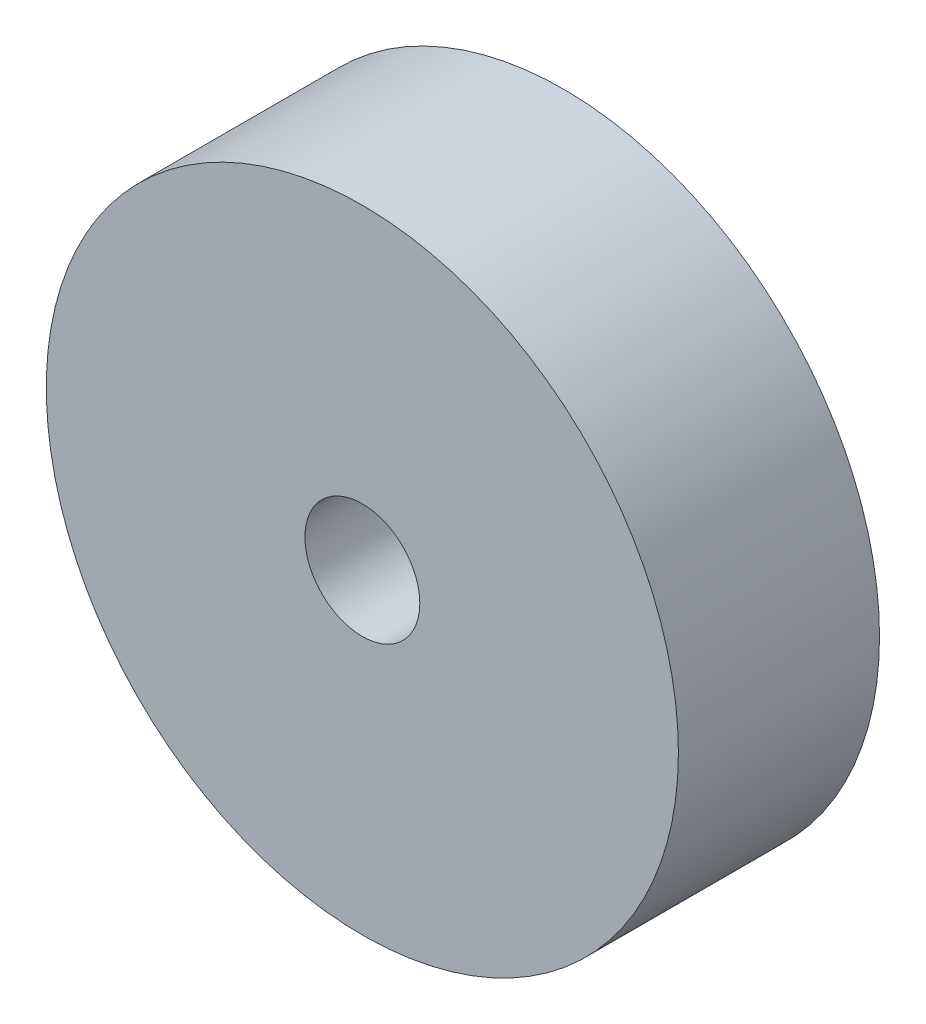
ISO-10303-21;
HEADER;
FILE_DESCRIPTION(('STEP AP214'),'2;1');
FILE_NAME('part.step','',(''),(''),'','','');
FILE_SCHEMA(('AUTOMOTIVE_DESIGN { 1 0 10303 214 1 1 1 1 }'));
ENDSEC;
DATA;
#1=APPLICATION_CONTEXT('core data for automotive mechanical design processes');
#2=APPLICATION_PROTOCOL_DEFINITION('international standard','automotive_design',2000,#1);
#3=PRODUCT_CONTEXT('',#1,'mechanical');
#4=PRODUCT('Part','Part','',(#3));
#5=PRODUCT_RELATED_PRODUCT_CATEGORY('part','',(#4));
#6=PRODUCT_DEFINITION_FORMATION('','',#4);
#7=PRODUCT_DEFINITION_CONTEXT('part definition',#1,'design');
#8=PRODUCT_DEFINITION('design','',#6,#7);
#9=PRODUCT_DEFINITION_SHAPE('','',#8);
#10=(LENGTH_UNIT() NAMED_UNIT(*) SI_UNIT(.MILLI.,.METRE.));
#11=(NAMED_UNIT(*) PLANE_ANGLE_UNIT() SI_UNIT($,.RADIAN.));
#12=(NAMED_UNIT(*) SI_UNIT($,.STERADIAN.) SOLID_ANGLE_UNIT());
#13=UNCERTAINTY_MEASURE_WITH_UNIT(LENGTH_MEASURE(1.E-05),#10,'distance_accuracy_value','');
#14=(GEOMETRIC_REPRESENTATION_CONTEXT(3) GLOBAL_UNCERTAINTY_ASSIGNED_CONTEXT((#13)) GLOBAL_UNIT_ASSIGNED_CONTEXT((#10,
#11,#12)) REPRESENTATION_CONTEXT('',''));
#15=CARTESIAN_POINT('',(0.,0.,0.));
#16=DIRECTION('',(0.,0.,1.));
#17=DIRECTION('',(1.,0.,0.));
#18=AXIS2_PLACEMENT_3D('',#15,#16,#17);
#19=CARTESIAN_POINT('',(0.,0.,7.));
#20=DIRECTION('',(0.,0.,1.));
#21=DIRECTION('',(1.,0.,0.));
#22=AXIS2_PLACEMENT_3D('',#19,#20,#21);
#23=PLANE('',#22);
#24=CARTESIAN_POINT('',(0.,0.,7.));
#25=DIRECTION('',(0.,0.,1.));
#26=DIRECTION('',(1.,0.,0.));
#27=AXIS2_PLACEMENT_3D('',#24,#25,#26);
#28=CIRCLE('',#27,11.);
#29=CARTESIAN_POINT('',(11.,0.,7.));
#30=VERTEX_POINT('',#29);
#31=EDGE_CURVE('E10',#30,#30,#28,.T.);
#32=ORIENTED_EDGE('',*,*,#31,.T.);
#33=EDGE_LOOP('',(#32));
#34=FACE_BOUND('',#33,.T.);
#35=CARTESIAN_POINT('',(0.,0.,7.));
#36=DIRECTION('',(0.,0.,1.));
#37=DIRECTION('',(1.,0.,0.));
#38=AXIS2_PLACEMENT_3D('',#35,#36,#37);
#39=CIRCLE('',#38,2.);
#40=CARTESIAN_POINT('',(2.,0.,7.));
#41=VERTEX_POINT('',#40);
#42=EDGE_CURVE('E41',#41,#41,#39,.T.);
#43=ORIENTED_EDGE('',*,*,#42,.F.);
#44=EDGE_LOOP('',(#43));
#45=FACE_BOUND('',#44,.T.);
#46=ADVANCED_FACE('F30',(#34,#45),#23,.T.);
#47=CARTESIAN_POINT('',(0.,0.,0.));
#48=DIRECTION('',(0.,0.,1.));
#49=DIRECTION('',(1.,0.,0.));
#50=AXIS2_PLACEMENT_3D('',#47,#48,#49);
#51=PLANE('',#50);
#52=CARTESIAN_POINT('',(0.,0.,0.));
#53=DIRECTION('',(0.,0.,1.));
#54=DIRECTION('',(1.,0.,0.));
#55=AXIS2_PLACEMENT_3D('',#52,#53,#54);
#56=CIRCLE('',#55,11.);
#57=CARTESIAN_POINT('',(11.,0.,0.));
#58=VERTEX_POINT('',#57);
#59=EDGE_CURVE('E34',#58,#58,#56,.T.);
#60=ORIENTED_EDGE('',*,*,#59,.F.);
#61=EDGE_LOOP('',(#60));
#62=FACE_BOUND('',#61,.T.);
#63=CARTESIAN_POINT('',(0.,0.,0.));
#64=DIRECTION('',(0.,0.,1.));
#65=DIRECTION('',(1.,0.,0.));
#66=AXIS2_PLACEMENT_3D('',#63,#64,#65);
#67=CIRCLE('',#66,2.);
#68=CARTESIAN_POINT('',(2.,0.,0.));
#69=VERTEX_POINT('',#68);
#70=EDGE_CURVE('E43',#69,#69,#67,.T.);
#71=ORIENTED_EDGE('',*,*,#70,.T.);
#72=EDGE_LOOP('',(#71));
#73=FACE_BOUND('',#72,.T.);
#74=ADVANCED_FACE('F53',(#62,#73),#51,.F.);
#75=CARTESIAN_POINT('',(0.,0.,7.));
#76=DIRECTION('',(0.,0.,-1.));
#77=DIRECTION('',(-1.,0.,0.));
#78=AXIS2_PLACEMENT_3D('',#75,#76,#77);
#79=CYLINDRICAL_SURFACE('',#78,11.);
#80=ORIENTED_EDGE('',*,*,#31,.F.);
#81=EDGE_LOOP('',(#80));
#82=FACE_BOUND('',#81,.T.);
#83=ORIENTED_EDGE('',*,*,#59,.T.);
#84=EDGE_LOOP('',(#83));
#85=FACE_BOUND('',#84,.T.);
#86=ADVANCED_FACE('F32',(#82,#85),#79,.T.);
#87=CARTESIAN_POINT('',(0.,0.,7.));
#88=DIRECTION('',(0.,0.,-1.));
#89=DIRECTION('',(-1.,0.,0.));
#90=AXIS2_PLACEMENT_3D('',#87,#88,#89);
#91=CYLINDRICAL_SURFACE('',#90,2.);
#92=ORIENTED_EDGE('',*,*,#42,.T.);
#93=EDGE_LOOP('',(#92));
#94=FACE_BOUND('',#93,.T.);
#95=ORIENTED_EDGE('',*,*,#70,.F.);
#96=EDGE_LOOP('',(#95));
#97=FACE_BOUND('',#96,.T.);
#98=ADVANCED_FACE('F49',(#94,#97),#91,.F.);
#99=CLOSED_SHELL('',(#46,#74,#86,#98));
#100=MANIFOLD_SOLID_BREP('B2',#99);
#101=ADVANCED_BREP_SHAPE_REPRESENTATION('',(#18,#100),#14);
#102=SHAPE_DEFINITION_REPRESENTATION(#9,#101);
ENDSEC;
END-ISO-10303-21;
